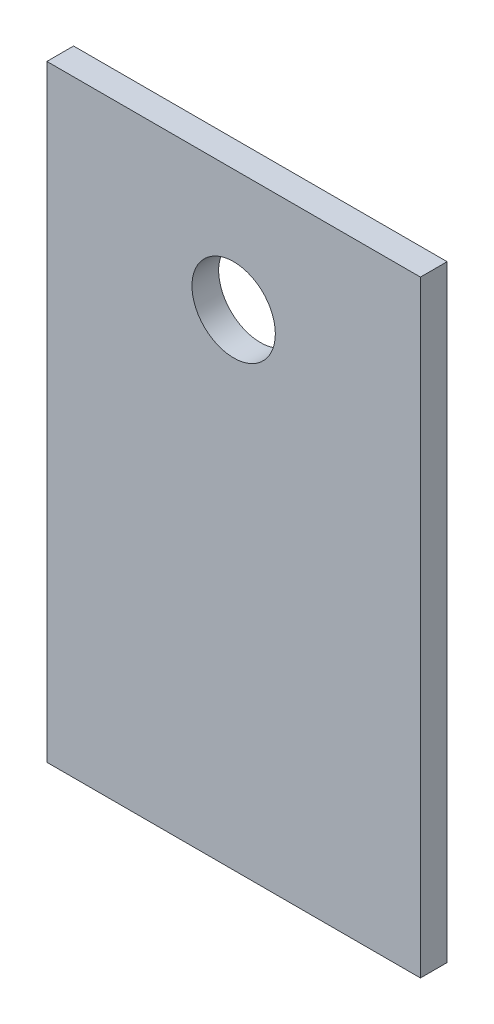
ISO-10303-21;
HEADER;
FILE_DESCRIPTION(('STEP AP214'),'2;1');
FILE_NAME('part.step','',(''),(''),'','','');
FILE_SCHEMA(('AUTOMOTIVE_DESIGN { 1 0 10303 214 1 1 1 1 }'));
ENDSEC;
DATA;
#1=APPLICATION_CONTEXT('core data for automotive mechanical design processes');
#2=APPLICATION_PROTOCOL_DEFINITION('international standard','automotive_design',2000,#1);
#3=PRODUCT_CONTEXT('',#1,'mechanical');
#4=PRODUCT('Part','Part','',(#3));
#5=PRODUCT_RELATED_PRODUCT_CATEGORY('part','',(#4));
#6=PRODUCT_DEFINITION_FORMATION('','',#4);
#7=PRODUCT_DEFINITION_CONTEXT('part definition',#1,'design');
#8=PRODUCT_DEFINITION('design','',#6,#7);
#9=PRODUCT_DEFINITION_SHAPE('','',#8);
#10=(LENGTH_UNIT() NAMED_UNIT(*) SI_UNIT(.MILLI.,.METRE.));
#11=(NAMED_UNIT(*) PLANE_ANGLE_UNIT() SI_UNIT($,.RADIAN.));
#12=(NAMED_UNIT(*) SI_UNIT($,.STERADIAN.) SOLID_ANGLE_UNIT());
#13=UNCERTAINTY_MEASURE_WITH_UNIT(LENGTH_MEASURE(1.E-05),#10,'distance_accuracy_value','');
#14=(GEOMETRIC_REPRESENTATION_CONTEXT(3) GLOBAL_UNCERTAINTY_ASSIGNED_CONTEXT((#13)) GLOBAL_UNIT_ASSIGNED_CONTEXT((#10,
#11,#12)) REPRESENTATION_CONTEXT('',''));
#15=CARTESIAN_POINT('',(0.,0.,0.));
#16=DIRECTION('',(0.,0.,1.));
#17=DIRECTION('',(1.,0.,0.));
#18=AXIS2_PLACEMENT_3D('',#15,#16,#17);
#19=CARTESIAN_POINT('',(-112.,-182.,16.));
#20=DIRECTION('',(1.,0.,0.));
#21=DIRECTION('',(0.,0.,-1.));
#22=AXIS2_PLACEMENT_3D('',#19,#20,#21);
#23=PLANE('',#22);
#24=DIRECTION('',(0.,-1.,0.));
#25=VECTOR('',#24,1.);
#26=CARTESIAN_POINT('',(-112.,-182.,0.));
#27=LINE('',#26,#25);
#28=CARTESIAN_POINT('',(-112.,182.,0.));
#29=VERTEX_POINT('',#28);
#30=CARTESIAN_POINT('',(-112.,-182.,0.));
#31=VERTEX_POINT('',#30);
#32=EDGE_CURVE('E111',#29,#31,#27,.T.);
#33=ORIENTED_EDGE('',*,*,#32,.T.);
#34=DIRECTION('',(0.,0.,-1.));
#35=VECTOR('',#34,1.);
#36=CARTESIAN_POINT('',(-112.,-182.,16.));
#37=LINE('',#36,#35);
#38=CARTESIAN_POINT('',(-112.,-182.,16.));
#39=VERTEX_POINT('',#38);
#40=EDGE_CURVE('E11',#39,#31,#37,.T.);
#41=ORIENTED_EDGE('',*,*,#40,.F.);
#42=DIRECTION('',(0.,-1.,0.));
#43=VECTOR('',#42,1.);
#44=CARTESIAN_POINT('',(-112.,-182.,16.));
#45=LINE('',#44,#43);
#46=CARTESIAN_POINT('',(-112.,182.,16.));
#47=VERTEX_POINT('',#46);
#48=EDGE_CURVE('E95',#47,#39,#45,.T.);
#49=ORIENTED_EDGE('',*,*,#48,.F.);
#50=DIRECTION('',(0.,0.,-1.));
#51=VECTOR('',#50,1.);
#52=CARTESIAN_POINT('',(-112.,182.,16.));
#53=LINE('',#52,#51);
#54=EDGE_CURVE('E107',#47,#29,#53,.T.);
#55=ORIENTED_EDGE('',*,*,#54,.T.);
#56=EDGE_LOOP('',(#33,#41,#49,#55));
#57=FACE_BOUND('',#56,.T.);
#58=ADVANCED_FACE('F43',(#57),#23,.F.);
#59=CARTESIAN_POINT('',(112.,-182.,16.));
#60=DIRECTION('',(0.,1.,0.));
#61=DIRECTION('',(0.,0.,1.));
#62=AXIS2_PLACEMENT_3D('',#59,#60,#61);
#63=PLANE('',#62);
#64=DIRECTION('',(1.,0.,0.));
#65=VECTOR('',#64,1.);
#66=CARTESIAN_POINT('',(112.,-182.,0.));
#67=LINE('',#66,#65);
#68=CARTESIAN_POINT('',(112.,-182.,0.));
#69=VERTEX_POINT('',#68);
#70=EDGE_CURVE('E100',#31,#69,#67,.T.);
#71=ORIENTED_EDGE('',*,*,#70,.T.);
#72=DIRECTION('',(0.,0.,-1.));
#73=VECTOR('',#72,1.);
#74=CARTESIAN_POINT('',(112.,-182.,16.));
#75=LINE('',#74,#73);
#76=CARTESIAN_POINT('',(112.,-182.,16.));
#77=VERTEX_POINT('',#76);
#78=EDGE_CURVE('E52',#77,#69,#75,.T.);
#79=ORIENTED_EDGE('',*,*,#78,.F.);
#80=DIRECTION('',(1.,0.,0.));
#81=VECTOR('',#80,1.);
#82=CARTESIAN_POINT('',(112.,-182.,16.));
#83=LINE('',#82,#81);
#84=EDGE_CURVE('E90',#39,#77,#83,.T.);
#85=ORIENTED_EDGE('',*,*,#84,.F.);
#86=ORIENTED_EDGE('',*,*,#40,.T.);
#87=EDGE_LOOP('',(#71,#79,#85,#86));
#88=FACE_BOUND('',#87,.T.);
#89=ADVANCED_FACE('F99',(#88),#63,.F.);
#90=CARTESIAN_POINT('',(112.,-182.,16.));
#91=DIRECTION('',(-1.,0.,0.));
#92=DIRECTION('',(0.,0.,1.));
#93=AXIS2_PLACEMENT_3D('',#90,#91,#92);
#94=PLANE('',#93);
#95=DIRECTION('',(0.,1.,0.));
#96=VECTOR('',#95,1.);
#97=CARTESIAN_POINT('',(112.,-182.,0.));
#98=LINE('',#97,#96);
#99=CARTESIAN_POINT('',(112.,182.,0.));
#100=VERTEX_POINT('',#99);
#101=EDGE_CURVE('E77',#69,#100,#98,.T.);
#102=ORIENTED_EDGE('',*,*,#101,.T.);
#103=DIRECTION('',(0.,0.,-1.));
#104=VECTOR('',#103,1.);
#105=CARTESIAN_POINT('',(112.,182.,16.));
#106=LINE('',#105,#104);
#107=CARTESIAN_POINT('',(112.,182.,16.));
#108=VERTEX_POINT('',#107);
#109=EDGE_CURVE('E102',#108,#100,#106,.T.);
#110=ORIENTED_EDGE('',*,*,#109,.F.);
#111=DIRECTION('',(0.,1.,0.));
#112=VECTOR('',#111,1.);
#113=CARTESIAN_POINT('',(112.,-182.,16.));
#114=LINE('',#113,#112);
#115=EDGE_CURVE('E93',#77,#108,#114,.T.);
#116=ORIENTED_EDGE('',*,*,#115,.F.);
#117=ORIENTED_EDGE('',*,*,#78,.T.);
#118=EDGE_LOOP('',(#102,#110,#116,#117));
#119=FACE_BOUND('',#118,.T.);
#120=ADVANCED_FACE('F103',(#119),#94,.F.);
#121=CARTESIAN_POINT('',(112.,182.,16.));
#122=DIRECTION('',(0.,-1.,0.));
#123=DIRECTION('',(1.,0.,0.));
#124=AXIS2_PLACEMENT_3D('',#121,#122,#123);
#125=PLANE('',#124);
#126=DIRECTION('',(-1.,0.,0.));
#127=VECTOR('',#126,1.);
#128=CARTESIAN_POINT('',(112.,182.,0.));
#129=LINE('',#128,#127);
#130=EDGE_CURVE('E83',#100,#29,#129,.T.);
#131=ORIENTED_EDGE('',*,*,#130,.T.);
#132=ORIENTED_EDGE('',*,*,#54,.F.);
#133=DIRECTION('',(-1.,0.,0.));
#134=VECTOR('',#133,1.);
#135=CARTESIAN_POINT('',(112.,182.,16.));
#136=LINE('',#135,#134);
#137=EDGE_CURVE('E60',#108,#47,#136,.T.);
#138=ORIENTED_EDGE('',*,*,#137,.F.);
#139=ORIENTED_EDGE('',*,*,#109,.T.);
#140=EDGE_LOOP('',(#131,#132,#138,#139));
#141=FACE_BOUND('',#140,.T.);
#142=ADVANCED_FACE('F125',(#141),#125,.F.);
#143=CARTESIAN_POINT('',(0.,0.,16.));
#144=DIRECTION('',(0.,0.,1.));
#145=DIRECTION('',(1.,0.,0.));
#146=AXIS2_PLACEMENT_3D('',#143,#144,#145);
#147=PLANE('',#146);
#148=CARTESIAN_POINT('',(0.,109.,16.));
#149=DIRECTION('',(0.,0.,1.));
#150=DIRECTION('',(1.,0.,0.));
#151=AXIS2_PLACEMENT_3D('',#148,#149,#150);
#152=CIRCLE('',#151,25.);
#153=CARTESIAN_POINT('',(25.,109.,16.));
#154=VERTEX_POINT('',#153);
#155=EDGE_CURVE('E132',#154,#154,#152,.T.);
#156=ORIENTED_EDGE('',*,*,#155,.F.);
#157=EDGE_LOOP('',(#156));
#158=FACE_BOUND('',#157,.T.);
#159=ORIENTED_EDGE('',*,*,#48,.T.);
#160=ORIENTED_EDGE('',*,*,#84,.T.);
#161=ORIENTED_EDGE('',*,*,#115,.T.);
#162=ORIENTED_EDGE('',*,*,#137,.T.);
#163=EDGE_LOOP('',(#159,#160,#161,#162));
#164=FACE_BOUND('',#163,.T.);
#165=ADVANCED_FACE('F91',(#158,#164),#147,.T.);
#166=CARTESIAN_POINT('',(0.,0.,0.));
#167=DIRECTION('',(0.,0.,1.));
#168=DIRECTION('',(1.,0.,0.));
#169=AXIS2_PLACEMENT_3D('',#166,#167,#168);
#170=PLANE('',#169);
#171=CARTESIAN_POINT('',(0.,109.,0.));
#172=DIRECTION('',(0.,0.,1.));
#173=DIRECTION('',(1.,0.,0.));
#174=AXIS2_PLACEMENT_3D('',#171,#172,#173);
#175=CIRCLE('',#174,25.);
#176=CARTESIAN_POINT('',(25.,109.,0.));
#177=VERTEX_POINT('',#176);
#178=EDGE_CURVE('E115',#177,#177,#175,.T.);
#179=ORIENTED_EDGE('',*,*,#178,.T.);
#180=EDGE_LOOP('',(#179));
#181=FACE_BOUND('',#180,.T.);
#182=ORIENTED_EDGE('',*,*,#32,.F.);
#183=ORIENTED_EDGE('',*,*,#130,.F.);
#184=ORIENTED_EDGE('',*,*,#101,.F.);
#185=ORIENTED_EDGE('',*,*,#70,.F.);
#186=EDGE_LOOP('',(#182,#183,#184,#185));
#187=FACE_BOUND('',#186,.T.);
#188=ADVANCED_FACE('F128',(#181,#187),#170,.F.);
#189=CARTESIAN_POINT('',(0.,109.,0.));
#190=DIRECTION('',(0.,0.,1.));
#191=DIRECTION('',(1.,0.,0.));
#192=AXIS2_PLACEMENT_3D('',#189,#190,#191);
#193=CYLINDRICAL_SURFACE('',#192,25.);
#194=ORIENTED_EDGE('',*,*,#178,.F.);
#195=EDGE_LOOP('',(#194));
#196=FACE_BOUND('',#195,.T.);
#197=ORIENTED_EDGE('',*,*,#155,.T.);
#198=EDGE_LOOP('',(#197));
#199=FACE_BOUND('',#198,.T.);
#200=ADVANCED_FACE('F141',(#196,#199),#193,.F.);
#201=CLOSED_SHELL('',(#58,#89,#120,#142,#165,#188,#200));
#202=MANIFOLD_SOLID_BREP('B2',#201);
#203=ADVANCED_BREP_SHAPE_REPRESENTATION('',(#18,#202),#14);
#204=SHAPE_DEFINITION_REPRESENTATION(#9,#203);
ENDSEC;
END-ISO-10303-21;
